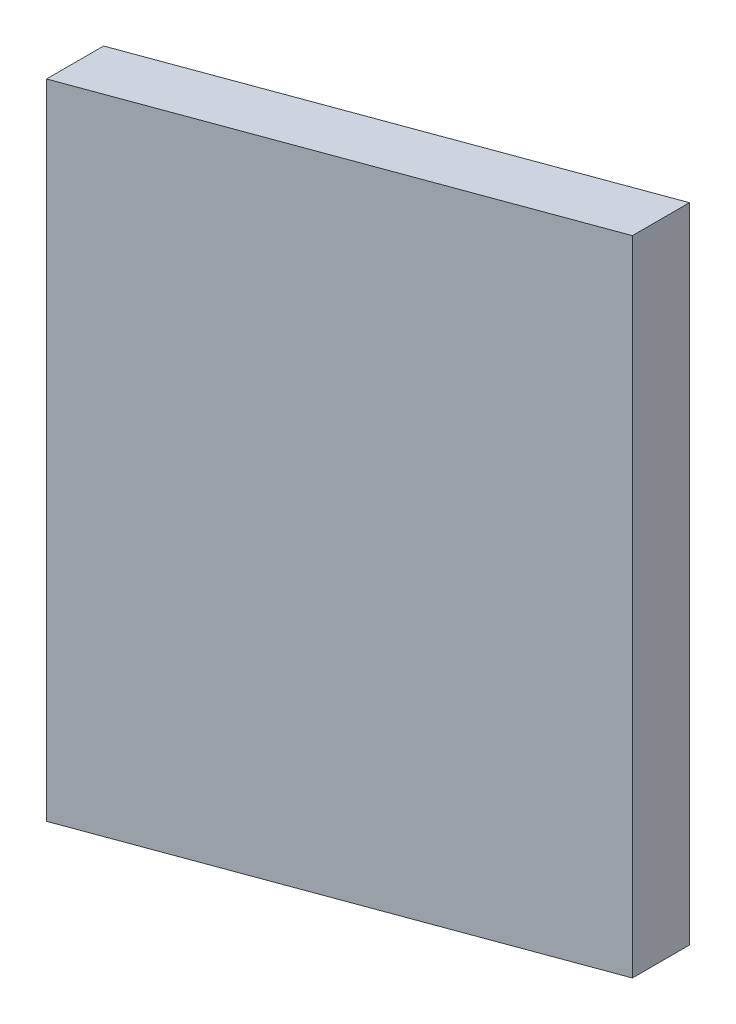
ISO-10303-21;
HEADER;
FILE_DESCRIPTION(('STEP AP214'),'2;1');
FILE_NAME('part.step','',(''),(''),'','','');
FILE_SCHEMA(('AUTOMOTIVE_DESIGN { 1 0 10303 214 1 1 1 1 }'));
ENDSEC;
DATA;
#1=APPLICATION_CONTEXT('core data for automotive mechanical design processes');
#2=APPLICATION_PROTOCOL_DEFINITION('international standard','automotive_design',2000,#1);
#3=PRODUCT_CONTEXT('',#1,'mechanical');
#4=PRODUCT('Part','Part','',(#3));
#5=PRODUCT_RELATED_PRODUCT_CATEGORY('part','',(#4));
#6=PRODUCT_DEFINITION_FORMATION('','',#4);
#7=PRODUCT_DEFINITION_CONTEXT('part definition',#1,'design');
#8=PRODUCT_DEFINITION('design','',#6,#7);
#9=PRODUCT_DEFINITION_SHAPE('','',#8);
#10=(LENGTH_UNIT() NAMED_UNIT(*) SI_UNIT(.MILLI.,.METRE.));
#11=(NAMED_UNIT(*) PLANE_ANGLE_UNIT() SI_UNIT($,.RADIAN.));
#12=(NAMED_UNIT(*) SI_UNIT($,.STERADIAN.) SOLID_ANGLE_UNIT());
#13=UNCERTAINTY_MEASURE_WITH_UNIT(LENGTH_MEASURE(1.E-05),#10,'distance_accuracy_value','');
#14=(GEOMETRIC_REPRESENTATION_CONTEXT(3) GLOBAL_UNCERTAINTY_ASSIGNED_CONTEXT((#13)) GLOBAL_UNIT_ASSIGNED_CONTEXT((#10,
#11,#12)) REPRESENTATION_CONTEXT('',''));
#15=CARTESIAN_POINT('',(0.,0.,0.));
#16=DIRECTION('',(0.,0.,1.));
#17=DIRECTION('',(1.,0.,0.));
#18=AXIS2_PLACEMENT_3D('',#15,#16,#17);
#19=CARTESIAN_POINT('',(0.,76.2,-6.76381391110526));
#20=DIRECTION('',(1.,0.,0.));
#21=DIRECTION('',(0.,0.,-1.));
#22=AXIS2_PLACEMENT_3D('',#19,#20,#21);
#23=PLANE('',#22);
#24=DIRECTION('',(0.,0.,1.));
#25=VECTOR('',#24,1.);
#26=CARTESIAN_POINT('',(0.,0.,-6.76381391110526));
#27=LINE('',#26,#25);
#28=CARTESIAN_POINT('',(0.,0.,-6.76381391110526));
#29=VERTEX_POINT('',#28);
#30=CARTESIAN_POINT('',(0.,0.,0.));
#31=VERTEX_POINT('',#30);
#32=EDGE_CURVE('E113',#29,#31,#27,.T.);
#33=ORIENTED_EDGE('',*,*,#32,.T.);
#34=DIRECTION('',(0.,-1.,0.));
#35=VECTOR('',#34,1.);
#36=CARTESIAN_POINT('',(0.,76.2,0.));
#37=LINE('',#36,#35);
#38=CARTESIAN_POINT('',(0.,76.2,0.));
#39=VERTEX_POINT('',#38);
#40=EDGE_CURVE('E11',#39,#31,#37,.T.);
#41=ORIENTED_EDGE('',*,*,#40,.F.);
#42=DIRECTION('',(0.,0.,1.));
#43=VECTOR('',#42,1.);
#44=CARTESIAN_POINT('',(0.,76.2,-6.76381391110526));
#45=LINE('',#44,#43);
#46=CARTESIAN_POINT('',(0.,76.2,-6.76381391110526));
#47=VERTEX_POINT('',#46);
#48=EDGE_CURVE('E97',#47,#39,#45,.T.);
#49=ORIENTED_EDGE('',*,*,#48,.F.);
#50=DIRECTION('',(0.,-1.,0.));
#51=VECTOR('',#50,1.);
#52=CARTESIAN_POINT('',(0.,76.2,-6.76381391110526));
#53=LINE('',#52,#51);
#54=EDGE_CURVE('E109',#47,#29,#53,.T.);
#55=ORIENTED_EDGE('',*,*,#54,.T.);
#56=EDGE_LOOP('',(#33,#41,#49,#55));
#57=FACE_BOUND('',#56,.T.);
#58=ADVANCED_FACE('F45',(#57),#23,.F.);
#59=CARTESIAN_POINT('',(0.,76.2,0.));
#60=DIRECTION('',(-0.344409720865779,0.,-0.938819441731559));
#61=DIRECTION('',(-0.938819441731559,0.,0.344409720865779));
#62=AXIS2_PLACEMENT_3D('',#59,#60,#61);
#63=PLANE('',#62);
#64=DIRECTION('',(0.938819441731559,0.,-0.344409720865779));
#65=VECTOR('',#64,1.);
#66=CARTESIAN_POINT('',(0.,0.,0.));
#67=LINE('',#66,#65);
#68=CARTESIAN_POINT('',(50.8,0.,-18.6361860888947));
#69=VERTEX_POINT('',#68);
#70=EDGE_CURVE('E102',#31,#69,#67,.T.);
#71=ORIENTED_EDGE('',*,*,#70,.T.);
#72=DIRECTION('',(0.,-1.,0.));
#73=VECTOR('',#72,1.);
#74=CARTESIAN_POINT('',(50.8,76.2,-18.6361860888947));
#75=LINE('',#74,#73);
#76=CARTESIAN_POINT('',(50.8,76.2,-18.6361860888947));
#77=VERTEX_POINT('',#76);
#78=EDGE_CURVE('E54',#77,#69,#75,.T.);
#79=ORIENTED_EDGE('',*,*,#78,.F.);
#80=DIRECTION('',(0.938819441731559,0.,-0.344409720865779));
#81=VECTOR('',#80,1.);
#82=CARTESIAN_POINT('',(0.,76.2,0.));
#83=LINE('',#82,#81);
#84=EDGE_CURVE('E92',#39,#77,#83,.T.);
#85=ORIENTED_EDGE('',*,*,#84,.F.);
#86=ORIENTED_EDGE('',*,*,#40,.T.);
#87=EDGE_LOOP('',(#71,#79,#85,#86));
#88=FACE_BOUND('',#87,.T.);
#89=ADVANCED_FACE('F101',(#88),#63,.F.);
#90=CARTESIAN_POINT('',(50.8,76.2,-18.6361860888947));
#91=DIRECTION('',(-1.,0.,0.));
#92=DIRECTION('',(0.,0.,1.));
#93=AXIS2_PLACEMENT_3D('',#90,#91,#92);
#94=PLANE('',#93);
#95=DIRECTION('',(0.,0.,-1.));
#96=VECTOR('',#95,1.);
#97=CARTESIAN_POINT('',(50.8,0.,-18.6361860888947));
#98=LINE('',#97,#96);
#99=CARTESIAN_POINT('',(50.8,0.,-25.4));
#100=VERTEX_POINT('',#99);
#101=EDGE_CURVE('E79',#69,#100,#98,.T.);
#102=ORIENTED_EDGE('',*,*,#101,.T.);
#103=DIRECTION('',(0.,-1.,0.));
#104=VECTOR('',#103,1.);
#105=CARTESIAN_POINT('',(50.8,76.2,-25.4));
#106=LINE('',#105,#104);
#107=CARTESIAN_POINT('',(50.8,76.2,-25.4));
#108=VERTEX_POINT('',#107);
#109=EDGE_CURVE('E104',#108,#100,#106,.T.);
#110=ORIENTED_EDGE('',*,*,#109,.F.);
#111=DIRECTION('',(0.,0.,-1.));
#112=VECTOR('',#111,1.);
#113=CARTESIAN_POINT('',(50.8,76.2,-18.6361860888947));
#114=LINE('',#113,#112);
#115=EDGE_CURVE('E95',#77,#108,#114,.T.);
#116=ORIENTED_EDGE('',*,*,#115,.F.);
#117=ORIENTED_EDGE('',*,*,#78,.T.);
#118=EDGE_LOOP('',(#102,#110,#116,#117));
#119=FACE_BOUND('',#118,.T.);
#120=ADVANCED_FACE('F105',(#119),#94,.F.);
#121=CARTESIAN_POINT('',(50.8,76.2,-25.4));
#122=DIRECTION('',(0.34440972086578,0.,0.938819441731559));
#123=DIRECTION('',(0.938819441731559,0.,-0.34440972086578));
#124=AXIS2_PLACEMENT_3D('',#121,#122,#123);
#125=PLANE('',#124);
#126=DIRECTION('',(-0.938819441731559,0.,0.34440972086578));
#127=VECTOR('',#126,1.);
#128=CARTESIAN_POINT('',(50.8,0.,-25.4));
#129=LINE('',#128,#127);
#130=EDGE_CURVE('E85',#100,#29,#129,.T.);
#131=ORIENTED_EDGE('',*,*,#130,.T.);
#132=ORIENTED_EDGE('',*,*,#54,.F.);
#133=DIRECTION('',(-0.938819441731559,0.,0.34440972086578));
#134=VECTOR('',#133,1.);
#135=CARTESIAN_POINT('',(50.8,76.2,-25.4));
#136=LINE('',#135,#134);
#137=EDGE_CURVE('E62',#108,#47,#136,.T.);
#138=ORIENTED_EDGE('',*,*,#137,.F.);
#139=ORIENTED_EDGE('',*,*,#109,.T.);
#140=EDGE_LOOP('',(#131,#132,#138,#139));
#141=FACE_BOUND('',#140,.T.);
#142=ADVANCED_FACE('F126',(#141),#125,.F.);
#143=CARTESIAN_POINT('',(0.,76.2,0.));
#144=DIRECTION('',(0.,1.,0.));
#145=DIRECTION('',(0.,0.,1.));
#146=AXIS2_PLACEMENT_3D('',#143,#144,#145);
#147=PLANE('',#146);
#148=ORIENTED_EDGE('',*,*,#48,.T.);
#149=ORIENTED_EDGE('',*,*,#84,.T.);
#150=ORIENTED_EDGE('',*,*,#115,.T.);
#151=ORIENTED_EDGE('',*,*,#137,.T.);
#152=EDGE_LOOP('',(#148,#149,#150,#151));
#153=FACE_BOUND('',#152,.T.);
#154=ADVANCED_FACE('F93',(#153),#147,.T.);
#155=CARTESIAN_POINT('',(0.,0.,0.));
#156=DIRECTION('',(0.,1.,0.));
#157=DIRECTION('',(0.,0.,1.));
#158=AXIS2_PLACEMENT_3D('',#155,#156,#157);
#159=PLANE('',#158);
#160=ORIENTED_EDGE('',*,*,#32,.F.);
#161=ORIENTED_EDGE('',*,*,#130,.F.);
#162=ORIENTED_EDGE('',*,*,#101,.F.);
#163=ORIENTED_EDGE('',*,*,#70,.F.);
#164=EDGE_LOOP('',(#160,#161,#162,#163));
#165=FACE_BOUND('',#164,.T.);
#166=ADVANCED_FACE('F129',(#165),#159,.F.);
#167=CLOSED_SHELL('',(#58,#89,#120,#142,#154,#166));
#168=MANIFOLD_SOLID_BREP('B2',#167);
#169=ADVANCED_BREP_SHAPE_REPRESENTATION('',(#18,#168),#14);
#170=SHAPE_DEFINITION_REPRESENTATION(#9,#169);
ENDSEC;
END-ISO-10303-21;
